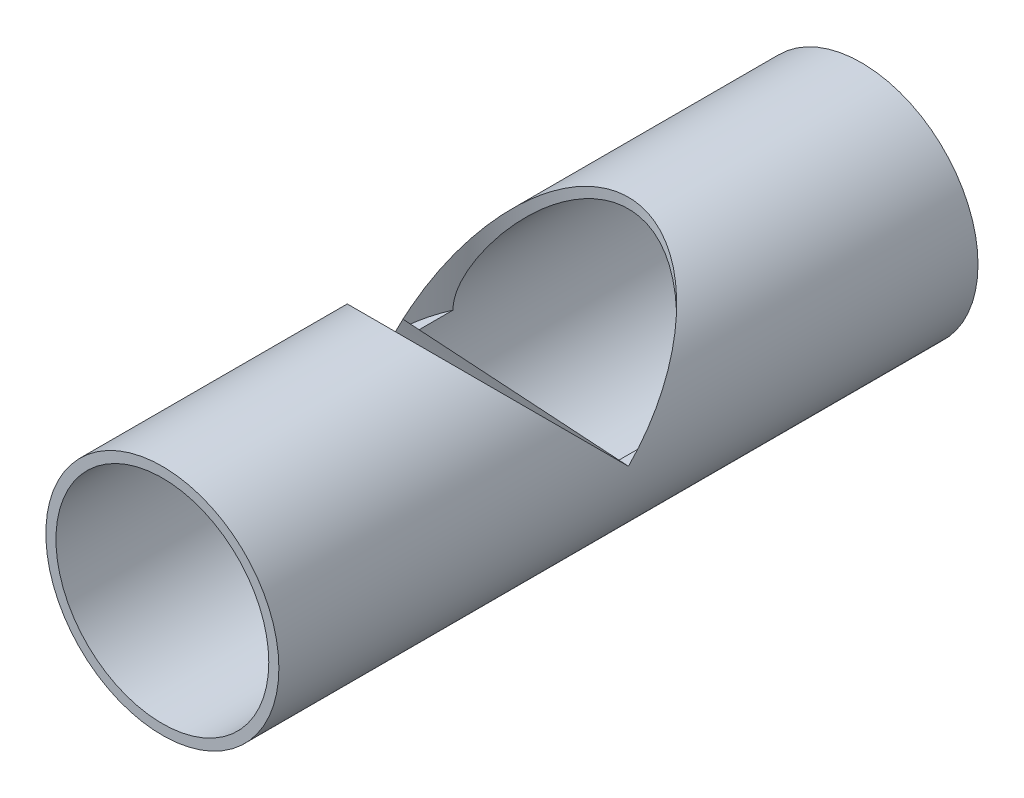
ISO-10303-21;
HEADER;
FILE_DESCRIPTION(('STEP AP214'),'2;1');
FILE_NAME('part.step','',(''),(''),'','','');
FILE_SCHEMA(('AUTOMOTIVE_DESIGN { 1 0 10303 214 1 1 1 1 }'));
ENDSEC;
DATA;
#1=APPLICATION_CONTEXT('core data for automotive mechanical design processes');
#2=APPLICATION_PROTOCOL_DEFINITION('international standard','automotive_design',2000,#1);
#3=PRODUCT_CONTEXT('',#1,'mechanical');
#4=PRODUCT('Part','Part','',(#3));
#5=PRODUCT_RELATED_PRODUCT_CATEGORY('part','',(#4));
#6=PRODUCT_DEFINITION_FORMATION('','',#4);
#7=PRODUCT_DEFINITION_CONTEXT('part definition',#1,'design');
#8=PRODUCT_DEFINITION('design','',#6,#7);
#9=PRODUCT_DEFINITION_SHAPE('','',#8);
#10=(LENGTH_UNIT() NAMED_UNIT(*) SI_UNIT(.MILLI.,.METRE.));
#11=(NAMED_UNIT(*) PLANE_ANGLE_UNIT() SI_UNIT($,.RADIAN.));
#12=(NAMED_UNIT(*) SI_UNIT($,.STERADIAN.) SOLID_ANGLE_UNIT());
#13=UNCERTAINTY_MEASURE_WITH_UNIT(LENGTH_MEASURE(1.E-05),#10,'distance_accuracy_value','');
#14=(GEOMETRIC_REPRESENTATION_CONTEXT(3) GLOBAL_UNCERTAINTY_ASSIGNED_CONTEXT((#13)) GLOBAL_UNIT_ASSIGNED_CONTEXT((#10,
#11,#12)) REPRESENTATION_CONTEXT('',''));
#15=CARTESIAN_POINT('',(0.,0.,0.));
#16=DIRECTION('',(0.,0.,1.));
#17=DIRECTION('',(1.,0.,0.));
#18=AXIS2_PLACEMENT_3D('',#15,#16,#17);
#19=CARTESIAN_POINT('',(0.,0.,57.15));
#20=DIRECTION('',(0.,-1.,0.));
#21=DIRECTION('',(0.,0.,-1.));
#22=AXIS2_PLACEMENT_3D('',#19,#20,#21);
#23=PLANE('',#22);
#24=CARTESIAN_POINT('',(0.,0.,57.15));
#25=DIRECTION('',(0.,1.,0.));
#26=DIRECTION('',(0.,0.,1.));
#27=AXIS2_PLACEMENT_3D('',#24,#25,#26);
#28=CIRCLE('',#27,19.05);
#29=CARTESIAN_POINT('',(-17.399,0.,49.3925971485297));
#30=VERTEX_POINT('',#29);
#31=CARTESIAN_POINT('',(-19.05,0.,57.15));
#32=VERTEX_POINT('',#31);
#33=EDGE_CURVE('E33',#30,#32,#28,.T.);
#34=ORIENTED_EDGE('',*,*,#33,.T.);
#35=CARTESIAN_POINT('',(0.,0.,57.15));
#36=DIRECTION('',(0.,1.,0.));
#37=DIRECTION('',(0.,0.,1.));
#38=AXIS2_PLACEMENT_3D('',#35,#36,#37);
#39=CIRCLE('',#38,19.05);
#40=CARTESIAN_POINT('',(-17.399,0.,64.9074028514703));
#41=VERTEX_POINT('',#40);
#42=EDGE_CURVE('E66',#32,#41,#39,.T.);
#43=ORIENTED_EDGE('',*,*,#42,.T.);
#44=DIRECTION('',(0.,0.,1.));
#45=VECTOR('',#44,1.);
#46=CARTESIAN_POINT('',(-17.399,0.,0.));
#47=LINE('',#46,#45);
#48=EDGE_CURVE('E58',#41,#30,#47,.F.);
#49=ORIENTED_EDGE('',*,*,#48,.T.);
#50=EDGE_LOOP('',(#34,#43,#49));
#51=FACE_BOUND('',#50,.T.);
#52=ADVANCED_FACE('F16',(#51),#23,.F.);
#53=CARTESIAN_POINT('',(0.,0.,57.15));
#54=DIRECTION('',(0.,-1.,0.));
#55=DIRECTION('',(0.,0.,-1.));
#56=AXIS2_PLACEMENT_3D('',#53,#54,#55);
#57=PLANE('',#56);
#58=CARTESIAN_POINT('',(0.,0.,57.15));
#59=DIRECTION('',(0.,1.,0.));
#60=DIRECTION('',(0.,0.,1.));
#61=AXIS2_PLACEMENT_3D('',#58,#59,#60);
#62=CIRCLE('',#61,19.05);
#63=CARTESIAN_POINT('',(17.399,0.,64.9074028514703));
#64=VERTEX_POINT('',#63);
#65=CARTESIAN_POINT('',(19.05,0.,57.15));
#66=VERTEX_POINT('',#65);
#67=EDGE_CURVE('E51',#64,#66,#62,.T.);
#68=ORIENTED_EDGE('',*,*,#67,.T.);
#69=CARTESIAN_POINT('',(0.,0.,57.15));
#70=DIRECTION('',(0.,1.,0.));
#71=DIRECTION('',(0.,0.,1.));
#72=AXIS2_PLACEMENT_3D('',#69,#70,#71);
#73=CIRCLE('',#72,19.05);
#74=CARTESIAN_POINT('',(17.399,0.,49.3925971485297));
#75=VERTEX_POINT('',#74);
#76=EDGE_CURVE('E54',#66,#75,#73,.T.);
#77=ORIENTED_EDGE('',*,*,#76,.T.);
#78=DIRECTION('',(0.,0.,1.));
#79=VECTOR('',#78,1.);
#80=CARTESIAN_POINT('',(17.399,0.,0.));
#81=LINE('',#80,#79);
#82=EDGE_CURVE('E47',#75,#64,#81,.T.);
#83=ORIENTED_EDGE('',*,*,#82,.T.);
#84=EDGE_LOOP('',(#68,#77,#83));
#85=FACE_BOUND('',#84,.T.);
#86=ADVANCED_FACE('F49',(#85),#57,.F.);
#87=CARTESIAN_POINT('',(0.,0.,0.));
#88=DIRECTION('',(0.,0.,1.));
#89=DIRECTION('',(1.,0.,0.));
#90=AXIS2_PLACEMENT_3D('',#87,#88,#89);
#91=CYLINDRICAL_SURFACE('',#90,17.399);
#92=CARTESIAN_POINT('',(0.,0.,0.));
#93=DIRECTION('',(0.,0.,1.));
#94=DIRECTION('',(1.,0.,0.));
#95=AXIS2_PLACEMENT_3D('',#92,#93,#94);
#96=CIRCLE('',#95,17.399);
#97=CARTESIAN_POINT('',(17.399,0.,0.));
#98=VERTEX_POINT('',#97);
#99=EDGE_CURVE('E117',#98,#98,#96,.T.);
#100=ORIENTED_EDGE('',*,*,#99,.F.);
#101=EDGE_LOOP('',(#100));
#102=FACE_BOUND('',#101,.T.);
#103=ORIENTED_EDGE('',*,*,#48,.F.);
#104=CARTESIAN_POINT('',(-17.399,0.,64.9074028514703));
#105=CARTESIAN_POINT('',(-17.3990027926557,0.126619411653412,64.9073892806763));
#106=CARTESIAN_POINT('',(-17.3976172953479,0.253213422142252,64.91050481767));
#107=CARTESIAN_POINT('',(-17.3920993093259,0.506011561056938,64.9228663106787));
#108=CARTESIAN_POINT('',(-17.3879674951789,0.632215777580591,64.9321107612707));
#109=CARTESIAN_POINT('',(-17.3715310393773,1.00902330778525,64.9687698671014));
#110=CARTESIAN_POINT('',(-17.3551849725285,1.25863541656879,65.005111937121));
#111=CARTESIAN_POINT('',(-17.3126787054344,1.74803233786395,65.0983443626753));
#112=CARTESIAN_POINT('',(-17.2867118539878,1.98791378893045,65.1548291232535));
#113=CARTESIAN_POINT('',(-17.2256220476168,2.4617617860572,65.2854561488629));
#114=CARTESIAN_POINT('',(-17.1904915826852,2.69572330712606,65.3596128925784));
#115=CARTESIAN_POINT('',(-17.0914704002142,3.27608545997221,65.5644416491115));
#116=CARTESIAN_POINT('',(-17.0220928683165,3.6182148201961,65.7045314532728));
#117=CARTESIAN_POINT('',(-16.8659507450822,4.2875618159471,66.008409139202));
#118=CARTESIAN_POINT('',(-16.7791763237468,4.6147708919803,66.1722104043654));
#119=CARTESIAN_POINT('',(-16.5885907607409,5.25908025866418,66.5180621575718));
#120=CARTESIAN_POINT('',(-16.4846028375362,5.57602990071133,66.7002934483331));
#121=CARTESIAN_POINT('',(-16.2611162606568,6.19761374754541,67.0760481170756));
#122=CARTESIAN_POINT('',(-16.1416117153161,6.50224321644266,67.2695757688457));
#123=CARTESIAN_POINT('',(-15.9012328343761,7.0682446326165,67.6427199440383));
#124=CARTESIAN_POINT('',(-15.7818795075659,7.33075234639333,67.8216028930283));
#125=CARTESIAN_POINT('',(-15.531375280231,7.84755054304734,68.1830066315397));
#126=CARTESIAN_POINT('',(-15.4002228366692,8.10183994524195,68.3655278944272));
#127=CARTESIAN_POINT('',(-15.1261173325553,8.60275103720113,68.7325543909568));
#128=CARTESIAN_POINT('',(-14.9831580377589,8.84936858024162,68.9170606274058));
#129=CARTESIAN_POINT('',(-14.6854749405307,9.33504840785214,69.2865419716062));
#130=CARTESIAN_POINT('',(-14.5307500246226,9.57410997430043,69.4715171221294));
#131=CARTESIAN_POINT('',(-14.0499414824725,10.2784757466186,70.023976753931));
#132=CARTESIAN_POINT('',(-13.706221982577,10.7327911450247,70.3903569500405));
#133=CARTESIAN_POINT('',(-12.9709988366539,11.6105902831832,71.1114056628348));
#134=CARTESIAN_POINT('',(-12.5795204493307,12.0340901330639,71.4660802453506));
#135=CARTESIAN_POINT('',(-11.8513027830295,12.7460780346226,72.0702493412787));
#136=CARTESIAN_POINT('',(-11.5252152004648,13.0419213680792,72.32393857843));
#137=CARTESIAN_POINT('',(-10.8451357651757,13.6126880208168,72.8172254345686));
#138=CARTESIAN_POINT('',(-10.4911442114866,13.8876115642246,73.0568232045201));
#139=CARTESIAN_POINT('',(-9.7556464324253,14.4137713143204,73.5182053590736));
#140=CARTESIAN_POINT('',(-9.37416774185507,14.6650306596365,73.7400071123435));
#141=CARTESIAN_POINT('',(-8.58390774378864,15.1411487148883,74.1623369264844));
#142=CARTESIAN_POINT('',(-8.17513251731963,15.3660132743823,74.3628696999896));
#143=CARTESIAN_POINT('',(-7.41609675759786,15.7438449488538,74.7010787980119));
#144=CARTESIAN_POINT('',(-7.07052907343838,15.9021892450143,74.8432976749746));
#145=CARTESIAN_POINT('',(-6.36382451687045,16.1979501260028,75.1095864108884));
#146=CARTESIAN_POINT('',(-6.00269106933714,16.3353712846128,75.2336602360993));
#147=CARTESIAN_POINT('',(-5.26647789377184,16.5873660705375,75.4616118596446));
#148=CARTESIAN_POINT('',(-4.89140366751787,16.7019485999545,75.5654975265765));
#149=CARTESIAN_POINT('',(-4.12923028647436,16.9065171053999,75.751230625274));
#150=CARTESIAN_POINT('',(-3.74213100127715,16.9965028145804,75.8330778179467));
#151=CARTESIAN_POINT('',(-2.95593537190508,17.1507769807365,75.9735337773239));
#152=CARTESIAN_POINT('',(-2.55677683000924,17.2148923872178,76.0319860313285));
#153=CARTESIAN_POINT('',(-1.75207798329658,17.3153056168189,76.1235785556383));
#154=CARTESIAN_POINT('',(-1.34653766138736,17.3516033654214,76.1567187581382));
#155=CARTESIAN_POINT('',(-0.532740871466237,17.3956140232931,76.1969054092446));
#156=CARTESIAN_POINT('',(-0.124485289769641,17.4033358417348,76.2039599906146));
#157=CARTESIAN_POINT('',(0.691145635542898,17.3900500247943,76.1918258138202));
#158=CARTESIAN_POINT('',(1.09852104488591,17.3690446145166,76.17263908821));
#159=CARTESIAN_POINT('',(1.86650740664488,17.3024305274246,76.1118364386318));
#160=CARTESIAN_POINT('',(2.22756908470294,17.2596128163397,76.0727652631555));
#161=CARTESIAN_POINT('',(2.94361664813322,17.1520079260685,75.9746695916722));
#162=CARTESIAN_POINT('',(3.2986030444039,17.0872226038712,75.9156467822389));
#163=CARTESIAN_POINT('',(4.00038341779028,16.9366748894927,75.7786682489914));
#164=CARTESIAN_POINT('',(4.34717668373007,16.8509106835957,75.700710888207));
#165=CARTESIAN_POINT('',(5.03073264287059,16.65961931318,75.5271216594109));
#166=CARTESIAN_POINT('',(5.36749474073483,16.5540909783843,75.4314887447959));
#167=CARTESIAN_POINT('',(6.04508836894759,16.319211609248,75.2190712727942));
#168=CARTESIAN_POINT('',(6.38536566225002,16.1889732182397,75.1015031398445));
#169=CARTESIAN_POINT('',(7.05200979717744,15.9099012910429,74.8502421296737));
#170=CARTESIAN_POINT('',(7.37837661185775,15.7610677188377,74.7165492212207));
#171=CARTESIAN_POINT('',(8.01637955747604,15.4463398391999,74.4347274052077));
#172=CARTESIAN_POINT('',(8.32801263159099,15.2804420139058,74.2865955213283));
#173=CARTESIAN_POINT('',(8.93593865373799,14.9330779736276,73.9775912941988));
#174=CARTESIAN_POINT('',(9.23222831724047,14.751608447154,73.8167162415391));
#175=CARTESIAN_POINT('',(9.96108070114769,14.2751141336036,73.39616265681));
#176=CARTESIAN_POINT('',(10.3832304302346,13.9706188807904,73.1290705087056));
#177=CARTESIAN_POINT('',(11.1906483352997,13.3326512383542,72.5743967388524));
#178=CARTESIAN_POINT('',(11.5758996118658,12.9991657033674,72.2868058328948));
#179=CARTESIAN_POINT('',(12.3107246973626,12.3055766392129,71.6954983316236));
#180=CARTESIAN_POINT('',(12.6601983724747,11.9454030182208,71.3917399093147));
#181=CARTESIAN_POINT('',(13.3228256699068,11.2015895641249,70.7738744147983));
#182=CARTESIAN_POINT('',(13.6359864105728,10.8179543527437,70.4597693863683));
#183=CARTESIAN_POINT('',(14.2338486111263,10.0188698517803,69.8187294700677));
#184=CARTESIAN_POINT('',(14.517686463156,9.60287793519724,69.4916676006417));
#185=CARTESIAN_POINT('',(15.0487827113267,8.74718214020968,68.838186754623));
#186=CARTESIAN_POINT('',(15.296023432836,8.30746694358544,68.5117681633014));
#187=CARTESIAN_POINT('',(15.6391176739874,7.6293606590487,68.0293160856903));
#188=CARTESIAN_POINT('',(15.7488029782035,7.40036468575161,67.869778727444));
#189=CARTESIAN_POINT('',(15.9589029321096,6.9356804418858,67.5544108647403));
#190=CARTESIAN_POINT('',(16.0593187405627,6.69999301263363,67.3985798987662));
#191=CARTESIAN_POINT('',(16.25064002581,6.22159236078595,67.0924221698046));
#192=CARTESIAN_POINT('',(16.3415534376162,5.97888521981352,66.9420908835962));
#193=CARTESIAN_POINT('',(16.5136633013956,5.48564865833397,66.6489623035712));
#194=CARTESIAN_POINT('',(16.5948621460068,5.23512118317328,66.5061631594989));
#195=CARTESIAN_POINT('',(16.7399044598348,4.74960595279282,66.2438654480011));
#196=CARTESIAN_POINT('',(16.8046633839798,4.51539494834859,66.1234411407302));
#197=CARTESIAN_POINT('',(16.9253972886873,4.03935876063698,65.8935847674936));
#198=CARTESIAN_POINT('',(16.981371807116,3.79753317758156,65.784153279952));
#199=CARTESIAN_POINT('',(17.0835577011958,3.30749209621931,65.5801538563993));
#200=CARTESIAN_POINT('',(17.1298288043977,3.05932691299981,65.4854959663158));
#201=CARTESIAN_POINT('',(17.2122316312634,2.55526916443492,65.3139853899444));
#202=CARTESIAN_POINT('',(17.2483680118588,2.29938020825195,65.2371245287159));
#203=CARTESIAN_POINT('',(17.2984619179857,1.87510757973664,65.1292141352051));
#204=CARTESIAN_POINT('',(17.3157056836072,1.70875077851934,65.0916704239793));
#205=CARTESIAN_POINT('',(17.3454986249527,1.37373521286453,65.0263862190104));
#206=CARTESIAN_POINT('',(17.35804919276,1.20507714643118,64.9986428184619));
#207=CARTESIAN_POINT('',(17.3783689967595,0.86423619591593,64.9535535854909));
#208=CARTESIAN_POINT('',(17.386085725966,0.692034904492633,64.9363219871161));
#209=CARTESIAN_POINT('',(17.3964114605965,0.34656692612635,64.9132082062703));
#210=CARTESIAN_POINT('',(17.3990157927525,0.173299409508221,64.9073364079205));
#211=CARTESIAN_POINT('',(17.399,0.,64.9074028514704));
#212=B_SPLINE_CURVE_WITH_KNOTS('',3,(#104,#105,#106,#107,#108,#109,#110,#111,#112,#113,#114,
#115,#116,#117,#118,#119,#120,#121,#122,#123,#124,#125,#126,#127,#128,#129,#130,#131,#132,#133,
#134,#135,#136,#137,#138,#139,#140,#141,#142,#143,#144,#145,#146,#147,#148,#149,#150,#151,#152,
#153,#154,#155,#156,#157,#158,#159,#160,#161,#162,#163,#164,#165,#166,#167,#168,#169,#170,#171,
#172,#173,#174,#175,#176,#177,#178,#179,#180,#181,#182,#183,#184,#185,#186,#187,#188,#189,#190,
#191,#192,#193,#194,#195,#196,#197,#198,#199,#200,#201,#202,#203,#204,#205,#206,#207,#208,#209,
#210,#211),.UNSPECIFIED.,.F.,.F.,(4,2,2,2,2,2,2,2,2,2,2,2,2,2,2,2,2,2,2,2,2,2,2,2,2,2,2,2,2,2,2,
2,2,2,2,2,2,2,2,2,2,2,2,2,2,2,2,2,2,2,2,2,2,4),(0.,0.379764092853833,0.759434940165909,
1.51634726991587,2.25880724087371,3.00187761458816,4.12835037763912,5.25546144985719,
6.3949616034871,7.53489569789875,8.55259337985784,9.57042434587642,10.5887962249633,
11.6072646010801,13.6367495933949,15.6651658480776,17.1883664070907,18.71155064481,
20.2332297195439,21.754570923617,22.9709961355442,24.187155054878,25.4028390055058,
26.6185361444175,27.8422355786928,29.0659382909752,30.2892594549617,31.5124858703965,
32.608284333679,33.7039901888642,34.7997908060849,35.8956563285599,37.043090764153,
38.1905274222329,39.3382011047017,40.4861194600479,42.2386035757021,43.991886525206,
45.749949583538,47.5076674278728,49.3075787665061,51.1083565581974,52.0077767250255,
52.9070843042516,53.8056348105301,54.7039635517724,55.5171752742101,56.3304297641096,
57.1385211097759,57.9462405247013,58.4601584642904,58.9739238458356,59.4931773421597,
60.0129052701034),.UNSPECIFIED.);
#213=EDGE_CURVE('E62',#41,#64,#212,.T.);
#214=ORIENTED_EDGE('',*,*,#213,.T.);
#215=ORIENTED_EDGE('',*,*,#82,.F.);
#216=CARTESIAN_POINT('',(17.399,0.,49.3925971485297));
#217=CARTESIAN_POINT('',(17.3990027926557,0.12661941165341,49.3926107193237));
#218=CARTESIAN_POINT('',(17.3976172953479,0.25321342214225,49.38949518233));
#219=CARTESIAN_POINT('',(17.3920993093259,0.506011561056936,49.3771336893213));
#220=CARTESIAN_POINT('',(17.3879674951789,0.632215777580588,49.3678892387293));
#221=CARTESIAN_POINT('',(17.3715310393773,1.00902330778525,49.3312301328986));
#222=CARTESIAN_POINT('',(17.3551849725285,1.25863541656879,49.294888062879));
#223=CARTESIAN_POINT('',(17.3126787054344,1.74803233786395,49.2016556373247));
#224=CARTESIAN_POINT('',(17.2867118539878,1.98791378893046,49.1451708767465));
#225=CARTESIAN_POINT('',(17.2256220476168,2.4617617860572,49.0145438511371));
#226=CARTESIAN_POINT('',(17.1904915826852,2.69572330712607,48.9403871074216));
#227=CARTESIAN_POINT('',(17.0914704002142,3.2760854599722,48.7355583508885));
#228=CARTESIAN_POINT('',(17.0220928683165,3.6182148201961,48.5954685467272));
#229=CARTESIAN_POINT('',(16.8659507450822,4.28756181594711,48.291590860798));
#230=CARTESIAN_POINT('',(16.7791763237468,4.6147708919803,48.1277895956346));
#231=CARTESIAN_POINT('',(16.5885907607409,5.25908025866418,47.7819378424282));
#232=CARTESIAN_POINT('',(16.4846028375362,5.57602990071133,47.5997065516669));
#233=CARTESIAN_POINT('',(16.2611162606568,6.19761374754541,47.2239518829244));
#234=CARTESIAN_POINT('',(16.1416117153161,6.50224321644265,47.0304242311543));
#235=CARTESIAN_POINT('',(15.9012328343761,7.06824463261649,46.6572800559617));
#236=CARTESIAN_POINT('',(15.7818795075659,7.33075234639333,46.4783971069717));
#237=CARTESIAN_POINT('',(15.531375280231,7.84755054304734,46.1169933684603));
#238=CARTESIAN_POINT('',(15.4002228366692,8.10183994524193,45.9344721055728));
#239=CARTESIAN_POINT('',(15.1261173325553,8.60275103720112,45.5674456090432));
#240=CARTESIAN_POINT('',(14.9831580377589,8.84936858024161,45.3829393725942));
#241=CARTESIAN_POINT('',(14.6854749405307,9.33504840785213,45.0134580283939));
#242=CARTESIAN_POINT('',(14.5307500246226,9.57410997430042,44.8284828778707));
#243=CARTESIAN_POINT('',(14.0499414824725,10.2784757466186,44.276023246069));
#244=CARTESIAN_POINT('',(13.706221982577,10.7327911450247,43.9096430499595));
#245=CARTESIAN_POINT('',(12.9709988366539,11.6105902831832,43.1885943371652));
#246=CARTESIAN_POINT('',(12.5795204493307,12.0340901330639,42.8339197546494));
#247=CARTESIAN_POINT('',(11.8513027830295,12.7460780346226,42.2297506587214));
#248=CARTESIAN_POINT('',(11.5252152004648,13.0419213680792,41.97606142157));
#249=CARTESIAN_POINT('',(10.8451357651757,13.6126880208168,41.4827745654314));
#250=CARTESIAN_POINT('',(10.4911442114866,13.8876115642246,41.2431767954799));
#251=CARTESIAN_POINT('',(9.7556464324253,14.4137713143204,40.7817946409264));
#252=CARTESIAN_POINT('',(9.37416774185507,14.6650306596365,40.5599928876565));
#253=CARTESIAN_POINT('',(8.58390774378864,15.1411487148883,40.1376630735156));
#254=CARTESIAN_POINT('',(8.17513251731962,15.3660132743823,39.9371303000104));
#255=CARTESIAN_POINT('',(7.41609675759786,15.7438449488538,39.5989212019881));
#256=CARTESIAN_POINT('',(7.07052907343837,15.9021892450143,39.4567023250254));
#257=CARTESIAN_POINT('',(6.36382451687044,16.1979501260028,39.1904135891116));
#258=CARTESIAN_POINT('',(6.00269106933713,16.3353712846128,39.0663397639007));
#259=CARTESIAN_POINT('',(5.26647789377183,16.5873660705375,38.8383881403555));
#260=CARTESIAN_POINT('',(4.89140366751786,16.7019485999545,38.7345024734235));
#261=CARTESIAN_POINT('',(4.12923028647435,16.9065171053999,38.548769374726));
#262=CARTESIAN_POINT('',(3.74213100127715,16.9965028145804,38.4669221820533));
#263=CARTESIAN_POINT('',(2.95593537190507,17.1507769807365,38.3264662226761));
#264=CARTESIAN_POINT('',(2.55677683000923,17.2148923872178,38.2680139686715));
#265=CARTESIAN_POINT('',(1.75207798329657,17.3153056168189,38.1764214443617));
#266=CARTESIAN_POINT('',(1.34653766138735,17.3516033654214,38.1432812418618));
#267=CARTESIAN_POINT('',(0.532740871466227,17.3956140232931,38.1030945907555));
#268=CARTESIAN_POINT('',(0.124485289769633,17.4033358417348,38.0960400093854));
#269=CARTESIAN_POINT('',(-0.691145635542906,17.3900500247943,38.1081741861798));
#270=CARTESIAN_POINT('',(-1.09852104488592,17.3690446145166,38.12736091179));
#271=CARTESIAN_POINT('',(-1.86650740664489,17.3024305274246,38.1881635613682));
#272=CARTESIAN_POINT('',(-2.22756908470294,17.2596128163397,38.2272347368446));
#273=CARTESIAN_POINT('',(-2.94361664813322,17.1520079260685,38.3253304083278));
#274=CARTESIAN_POINT('',(-3.2986030444039,17.0872226038712,38.3843532177611));
#275=CARTESIAN_POINT('',(-4.00038341779028,16.9366748894927,38.5213317510087));
#276=CARTESIAN_POINT('',(-4.34717668373008,16.8509106835957,38.5992891117931));
#277=CARTESIAN_POINT('',(-5.0307326428706,16.65961931318,38.7728783405891));
#278=CARTESIAN_POINT('',(-5.36749474073484,16.5540909783843,38.8685112552042));
#279=CARTESIAN_POINT('',(-6.04508836894759,16.319211609248,39.0809287272059));
#280=CARTESIAN_POINT('',(-6.38536566225003,16.1889732182396,39.1984968601555));
#281=CARTESIAN_POINT('',(-7.05200979717745,15.9099012910429,39.4497578703263));
#282=CARTESIAN_POINT('',(-7.37837661185776,15.7610677188377,39.5834507787793));
#283=CARTESIAN_POINT('',(-8.01637955747605,15.4463398391999,39.8652725947923));
#284=CARTESIAN_POINT('',(-8.32801263159099,15.2804420139058,40.0134044786717));
#285=CARTESIAN_POINT('',(-8.93593865373799,14.9330779736276,40.3224087058013));
#286=CARTESIAN_POINT('',(-9.23222831724047,14.751608447154,40.4832837584609));
#287=CARTESIAN_POINT('',(-9.9610807011477,14.2751141336036,40.90383734319));
#288=CARTESIAN_POINT('',(-10.3832304302346,13.9706188807904,41.1709294912944));
#289=CARTESIAN_POINT('',(-11.1906483352997,13.3326512383542,41.7256032611476));
#290=CARTESIAN_POINT('',(-11.5758996118658,12.9991657033674,42.0131941671052));
#291=CARTESIAN_POINT('',(-12.3107246973626,12.3055766392129,42.6045016683764));
#292=CARTESIAN_POINT('',(-12.6601983724747,11.9454030182208,42.9082600906854));
#293=CARTESIAN_POINT('',(-13.3228256699068,11.2015895641249,43.5261255852017));
#294=CARTESIAN_POINT('',(-13.6359864105728,10.8179543527437,43.8402306136318));
#295=CARTESIAN_POINT('',(-14.2338486111263,10.0188698517803,44.4812705299324));
#296=CARTESIAN_POINT('',(-14.517686463156,9.60287793519723,44.8083323993583));
#297=CARTESIAN_POINT('',(-15.0487827113267,8.74718214020968,45.461813245377));
#298=CARTESIAN_POINT('',(-15.296023432836,8.30746694358544,45.7882318366987));
#299=CARTESIAN_POINT('',(-15.6391176739874,7.6293606590487,46.2706839143097));
#300=CARTESIAN_POINT('',(-15.7488029782035,7.40036468575161,46.430221272556));
#301=CARTESIAN_POINT('',(-15.9589029321096,6.93568044188581,46.7455891352597));
#302=CARTESIAN_POINT('',(-16.0593187405627,6.69999301263364,46.9014201012338));
#303=CARTESIAN_POINT('',(-16.25064002581,6.22159236078596,47.2075778301954));
#304=CARTESIAN_POINT('',(-16.3415534376162,5.97888521981353,47.3579091164038));
#305=CARTESIAN_POINT('',(-16.5136633013956,5.48564865833398,47.6510376964288));
#306=CARTESIAN_POINT('',(-16.5948621460068,5.23512118317328,47.7938368405011));
#307=CARTESIAN_POINT('',(-16.7399044598348,4.74960595279281,48.0561345519989));
#308=CARTESIAN_POINT('',(-16.8046633839798,4.51539494834858,48.1765588592699));
#309=CARTESIAN_POINT('',(-16.9253972886873,4.03935876063698,48.4064152325064));
#310=CARTESIAN_POINT('',(-16.981371807116,3.79753317758156,48.515846720048));
#311=CARTESIAN_POINT('',(-17.0835577011958,3.30749209621931,48.7198461436007));
#312=CARTESIAN_POINT('',(-17.1298288043977,3.05932691299981,48.8145040336842));
#313=CARTESIAN_POINT('',(-17.2122316312634,2.55526916443492,48.9860146100556));
#314=CARTESIAN_POINT('',(-17.2483680118588,2.29938020825194,49.0628754712841));
#315=CARTESIAN_POINT('',(-17.2984619179858,1.87510757973663,49.1707858647949));
#316=CARTESIAN_POINT('',(-17.3157056836072,1.70875077851933,49.2083295760207));
#317=CARTESIAN_POINT('',(-17.3454986249527,1.37373521286453,49.2736137809896));
#318=CARTESIAN_POINT('',(-17.35804919276,1.20507714643118,49.3013571815381));
#319=CARTESIAN_POINT('',(-17.3783689967595,0.864236195915931,49.3464464145092));
#320=CARTESIAN_POINT('',(-17.386085725966,0.692034904492635,49.3636780128839));
#321=CARTESIAN_POINT('',(-17.3964114605965,0.346566926126353,49.3867917937297));
#322=CARTESIAN_POINT('',(-17.3990157927525,0.173299409508221,49.3926635920795));
#323=CARTESIAN_POINT('',(-17.399,0.,49.3925971485297));
#324=B_SPLINE_CURVE_WITH_KNOTS('',3,(#216,#217,#218,#219,#220,#221,#222,#223,#224,#225,#226,
#227,#228,#229,#230,#231,#232,#233,#234,#235,#236,#237,#238,#239,#240,#241,#242,#243,#244,#245,
#246,#247,#248,#249,#250,#251,#252,#253,#254,#255,#256,#257,#258,#259,#260,#261,#262,#263,#264,
#265,#266,#267,#268,#269,#270,#271,#272,#273,#274,#275,#276,#277,#278,#279,#280,#281,#282,#283,
#284,#285,#286,#287,#288,#289,#290,#291,#292,#293,#294,#295,#296,#297,#298,#299,#300,#301,#302,
#303,#304,#305,#306,#307,#308,#309,#310,#311,#312,#313,#314,#315,#316,#317,#318,#319,#320,#321,
#322,#323),.UNSPECIFIED.,.F.,.F.,(4,2,2,2,2,2,2,2,2,2,2,2,2,2,2,2,2,2,2,2,2,2,2,2,2,2,2,2,2,2,2,
2,2,2,2,2,2,2,2,2,2,2,2,2,2,2,2,2,2,2,2,2,2,4),(0.,0.379764092853832,0.759434940165908,
1.51634726991587,2.25880724087371,3.00187761458816,4.12835037763912,5.25546144985719,
6.39496160348711,7.53489569789875,8.55259337985783,9.57042434587641,10.5887962249633,
11.6072646010801,13.6367495933949,15.6651658480776,17.1883664070907,18.71155064481,
20.2332297195439,21.754570923617,22.9709961355442,24.187155054878,25.4028390055058,
26.6185361444175,27.8422355786928,29.0659382909752,30.2892594549617,31.5124858703965,
32.608284333679,33.7039901888642,34.7997908060849,35.8956563285599,37.043090764153,
38.1905274222329,39.3382011047017,40.4861194600479,42.2386035757021,43.991886525206,
45.749949583538,47.5076674278728,49.3075787665061,51.1083565581975,52.0077767250255,
52.9070843042516,53.8056348105302,54.7039635517725,55.5171752742101,56.3304297641096,
57.1385211097759,57.9462405247014,58.4601584642904,58.9739238458356,59.4931773421598,
60.0129052701035),.UNSPECIFIED.);
#325=EDGE_CURVE('E121',#75,#30,#324,.T.);
#326=ORIENTED_EDGE('',*,*,#325,.T.);
#327=EDGE_LOOP('',(#103,#214,#215,#326));
#328=FACE_BOUND('',#327,.T.);
#329=CARTESIAN_POINT('',(0.,0.,114.3));
#330=DIRECTION('',(0.,0.,1.));
#331=DIRECTION('',(1.,0.,0.));
#332=AXIS2_PLACEMENT_3D('',#329,#330,#331);
#333=CIRCLE('',#332,17.399);
#334=CARTESIAN_POINT('',(17.399,0.,114.3));
#335=VERTEX_POINT('',#334);
#336=EDGE_CURVE('E19',#335,#335,#333,.T.);
#337=ORIENTED_EDGE('',*,*,#336,.T.);
#338=EDGE_LOOP('',(#337));
#339=FACE_BOUND('',#338,.T.);
#340=ADVANCED_FACE('F63',(#102,#328,#339),#91,.F.);
#341=CARTESIAN_POINT('',(0.,0.,114.3));
#342=DIRECTION('',(0.,0.,-1.));
#343=DIRECTION('',(-1.,0.,0.));
#344=AXIS2_PLACEMENT_3D('',#341,#342,#343);
#345=PLANE('',#344);
#346=ORIENTED_EDGE('',*,*,#336,.F.);
#347=EDGE_LOOP('',(#346));
#348=FACE_BOUND('',#347,.T.);
#349=CARTESIAN_POINT('',(0.,0.,114.3));
#350=DIRECTION('',(0.,0.,1.));
#351=DIRECTION('',(1.,0.,0.));
#352=AXIS2_PLACEMENT_3D('',#349,#350,#351);
#353=CIRCLE('',#352,19.05);
#354=CARTESIAN_POINT('',(19.05,0.,114.3));
#355=VERTEX_POINT('',#354);
#356=EDGE_CURVE('E116',#355,#355,#353,.F.);
#357=ORIENTED_EDGE('',*,*,#356,.F.);
#358=EDGE_LOOP('',(#357));
#359=FACE_BOUND('',#358,.T.);
#360=ADVANCED_FACE('F86',(#348,#359),#345,.F.);
#361=CARTESIAN_POINT('',(0.,0.,57.15));
#362=DIRECTION('',(0.,1.,0.));
#363=DIRECTION('',(0.,0.,1.));
#364=AXIS2_PLACEMENT_3D('',#361,#362,#363);
#365=CYLINDRICAL_SURFACE('',#364,19.05);
#366=ORIENTED_EDGE('',*,*,#42,.F.);
#367=CARTESIAN_POINT('',(0.,0.,57.15));
#368=DIRECTION('',(0.,-0.707106781186547,0.707106781186547));
#369=DIRECTION('',(0.,0.707106781186547,0.707106781186547));
#370=AXIS2_PLACEMENT_3D('',#367,#368,#369);
#371=ELLIPSE('',#370,26.9407683632075,19.05);
#372=EDGE_CURVE('E70',#66,#32,#371,.T.);
#373=ORIENTED_EDGE('',*,*,#372,.F.);
#374=ORIENTED_EDGE('',*,*,#67,.F.);
#375=ORIENTED_EDGE('',*,*,#213,.F.);
#376=EDGE_LOOP('',(#366,#373,#374,#375));
#377=FACE_BOUND('',#376,.T.);
#378=ADVANCED_FACE('F68',(#377),#365,.F.);
#379=CARTESIAN_POINT('',(0.,0.,57.15));
#380=DIRECTION('',(0.,1.,0.));
#381=DIRECTION('',(0.,0.,1.));
#382=AXIS2_PLACEMENT_3D('',#379,#380,#381);
#383=CYLINDRICAL_SURFACE('',#382,19.05);
#384=ORIENTED_EDGE('',*,*,#76,.F.);
#385=CARTESIAN_POINT('',(0.,0.,57.15));
#386=DIRECTION('',(0.,0.707106781186547,0.707106781186547));
#387=DIRECTION('',(0.,0.707106781186547,-0.707106781186547));
#388=AXIS2_PLACEMENT_3D('',#385,#386,#387);
#389=ELLIPSE('',#388,26.9407683632075,19.05);
#390=EDGE_CURVE('E25',#32,#66,#389,.F.);
#391=ORIENTED_EDGE('',*,*,#390,.F.);
#392=ORIENTED_EDGE('',*,*,#33,.F.);
#393=ORIENTED_EDGE('',*,*,#325,.F.);
#394=EDGE_LOOP('',(#384,#391,#392,#393));
#395=FACE_BOUND('',#394,.T.);
#396=ADVANCED_FACE('F85',(#395),#383,.F.);
#397=CARTESIAN_POINT('',(0.,0.,0.));
#398=DIRECTION('',(0.,0.,-1.));
#399=DIRECTION('',(-1.,0.,0.));
#400=AXIS2_PLACEMENT_3D('',#397,#398,#399);
#401=PLANE('',#400);
#402=ORIENTED_EDGE('',*,*,#99,.T.);
#403=EDGE_LOOP('',(#402));
#404=FACE_BOUND('',#403,.T.);
#405=CARTESIAN_POINT('',(0.,0.,0.));
#406=DIRECTION('',(0.,0.,1.));
#407=DIRECTION('',(1.,0.,0.));
#408=AXIS2_PLACEMENT_3D('',#405,#406,#407);
#409=CIRCLE('',#408,19.05);
#410=CARTESIAN_POINT('',(19.05,0.,0.));
#411=VERTEX_POINT('',#410);
#412=EDGE_CURVE('E11',#411,#411,#409,.T.);
#413=ORIENTED_EDGE('',*,*,#412,.F.);
#414=EDGE_LOOP('',(#413));
#415=FACE_BOUND('',#414,.T.);
#416=ADVANCED_FACE('F101',(#404,#415),#401,.T.);
#417=CARTESIAN_POINT('',(0.,0.,0.));
#418=DIRECTION('',(0.,0.,1.));
#419=DIRECTION('',(1.,0.,0.));
#420=AXIS2_PLACEMENT_3D('',#417,#418,#419);
#421=CYLINDRICAL_SURFACE('',#420,19.05);
#422=ORIENTED_EDGE('',*,*,#412,.T.);
#423=EDGE_LOOP('',(#422));
#424=FACE_BOUND('',#423,.T.);
#425=ORIENTED_EDGE('',*,*,#372,.T.);
#426=ORIENTED_EDGE('',*,*,#390,.T.);
#427=EDGE_LOOP('',(#425,#426));
#428=FACE_BOUND('',#427,.T.);
#429=ORIENTED_EDGE('',*,*,#356,.T.);
#430=EDGE_LOOP('',(#429));
#431=FACE_BOUND('',#430,.T.);
#432=ADVANCED_FACE('F99',(#424,#428,#431),#421,.T.);
#433=CLOSED_SHELL('',(#52,#86,#340,#360,#378,#396,#416,#432));
#434=MANIFOLD_SOLID_BREP('B1',#433);
#435=ADVANCED_BREP_SHAPE_REPRESENTATION('',(#18,#434),#14);
#436=SHAPE_DEFINITION_REPRESENTATION(#9,#435);
ENDSEC;
END-ISO-10303-21;
